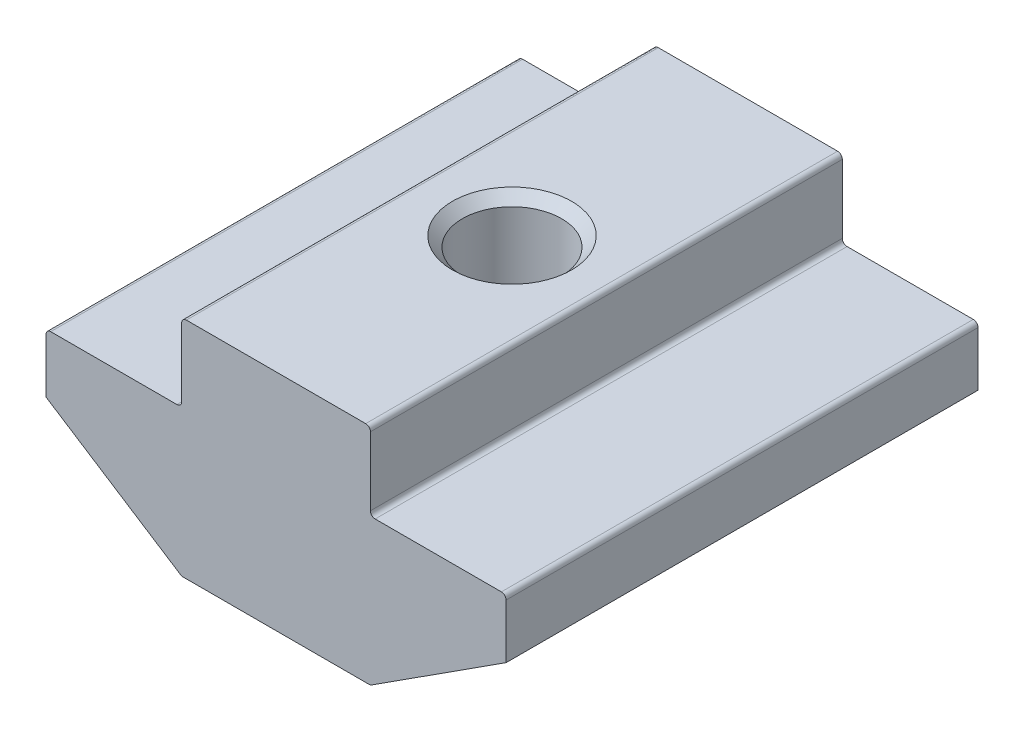
ISO-10303-21;
HEADER;
FILE_DESCRIPTION(('STEP AP214'),'2;1');
FILE_NAME('part.step','',(''),(''),'','','');
FILE_SCHEMA(('AUTOMOTIVE_DESIGN { 1 0 10303 214 1 1 1 1 }'));
ENDSEC;
DATA;
#1=APPLICATION_CONTEXT('core data for automotive mechanical design processes');
#2=APPLICATION_PROTOCOL_DEFINITION('international standard','automotive_design',2000,#1);
#3=PRODUCT_CONTEXT('',#1,'mechanical');
#4=PRODUCT('Part','Part','',(#3));
#5=PRODUCT_RELATED_PRODUCT_CATEGORY('part','',(#4));
#6=PRODUCT_DEFINITION_FORMATION('','',#4);
#7=PRODUCT_DEFINITION_CONTEXT('part definition',#1,'design');
#8=PRODUCT_DEFINITION('design','',#6,#7);
#9=PRODUCT_DEFINITION_SHAPE('','',#8);
#10=(LENGTH_UNIT() NAMED_UNIT(*) SI_UNIT(.MILLI.,.METRE.));
#11=(NAMED_UNIT(*) PLANE_ANGLE_UNIT() SI_UNIT($,.RADIAN.));
#12=(NAMED_UNIT(*) SI_UNIT($,.STERADIAN.) SOLID_ANGLE_UNIT());
#13=UNCERTAINTY_MEASURE_WITH_UNIT(LENGTH_MEASURE(1.E-05),#10,'distance_accuracy_value','');
#14=(GEOMETRIC_REPRESENTATION_CONTEXT(3) GLOBAL_UNCERTAINTY_ASSIGNED_CONTEXT((#13)) GLOBAL_UNIT_ASSIGNED_CONTEXT((#10,
#11,#12)) REPRESENTATION_CONTEXT('',''));
#15=CARTESIAN_POINT('',(0.,0.,0.));
#16=DIRECTION('',(0.,0.,1.));
#17=DIRECTION('',(1.,0.,0.));
#18=AXIS2_PLACEMENT_3D('',#15,#16,#17);
#19=CARTESIAN_POINT('',(-4.,0.,10.));
#20=DIRECTION('',(1.,0.,0.));
#21=DIRECTION('',(0.,0.,-1.));
#22=AXIS2_PLACEMENT_3D('',#19,#20,#21);
#23=PLANE('',#22);
#24=DIRECTION('',(0.,-1.,0.));
#25=VECTOR('',#24,1.);
#26=CARTESIAN_POINT('',(-4.,0.,10.));
#27=LINE('',#26,#25);
#28=CARTESIAN_POINT('',(-4.,-0.200000000000002,10.));
#29=VERTEX_POINT('',#28);
#30=CARTESIAN_POINT('',(-4.,-3.1,10.));
#31=VERTEX_POINT('',#30);
#32=EDGE_CURVE('E234',#29,#31,#27,.T.);
#33=ORIENTED_EDGE('',*,*,#32,.F.);
#34=DIRECTION('',(0.,0.,-1.));
#35=VECTOR('',#34,1.);
#36=CARTESIAN_POINT('',(-4.,-0.200000000000002,10.));
#37=LINE('',#36,#35);
#38=CARTESIAN_POINT('',(-4.,-0.200000000000002,-10.));
#39=VERTEX_POINT('',#38);
#40=EDGE_CURVE('E285',#29,#39,#37,.T.);
#41=ORIENTED_EDGE('',*,*,#40,.T.);
#42=DIRECTION('',(0.,-1.,0.));
#43=VECTOR('',#42,1.);
#44=CARTESIAN_POINT('',(-4.,0.,-10.));
#45=LINE('',#44,#43);
#46=CARTESIAN_POINT('',(-4.,-3.1,-10.));
#47=VERTEX_POINT('',#46);
#48=EDGE_CURVE('E208',#39,#47,#45,.T.);
#49=ORIENTED_EDGE('',*,*,#48,.T.);
#50=DIRECTION('',(0.,0.,-1.));
#51=VECTOR('',#50,1.);
#52=CARTESIAN_POINT('',(-4.,-3.1,10.));
#53=LINE('',#52,#51);
#54=EDGE_CURVE('E283',#47,#31,#53,.F.);
#55=ORIENTED_EDGE('',*,*,#54,.T.);
#56=EDGE_LOOP('',(#33,#41,#49,#55));
#57=FACE_BOUND('',#56,.T.);
#58=ADVANCED_FACE('F37',(#57),#23,.F.);
#59=CARTESIAN_POINT('',(-4.,-3.3,10.));
#60=DIRECTION('',(0.,-1.,0.));
#61=DIRECTION('',(1.,0.,0.));
#62=AXIS2_PLACEMENT_3D('',#59,#60,#61);
#63=PLANE('',#62);
#64=DIRECTION('',(-1.,0.,0.));
#65=VECTOR('',#64,1.);
#66=CARTESIAN_POINT('',(-4.,-3.3,-10.));
#67=LINE('',#66,#65);
#68=CARTESIAN_POINT('',(-4.2,-3.3,-10.));
#69=VERTEX_POINT('',#68);
#70=CARTESIAN_POINT('',(-9.55,-3.3,-10.));
#71=VERTEX_POINT('',#70);
#72=EDGE_CURVE('E211',#69,#71,#67,.T.);
#73=ORIENTED_EDGE('',*,*,#72,.T.);
#74=DIRECTION('',(0.,0.,-1.));
#75=VECTOR('',#74,1.);
#76=CARTESIAN_POINT('',(-9.55,-3.3,10.));
#77=LINE('',#76,#75);
#78=CARTESIAN_POINT('',(-9.55,-3.3,10.));
#79=VERTEX_POINT('',#78);
#80=EDGE_CURVE('E293',#71,#79,#77,.F.);
#81=ORIENTED_EDGE('',*,*,#80,.T.);
#82=DIRECTION('',(-1.,0.,0.));
#83=VECTOR('',#82,1.);
#84=CARTESIAN_POINT('',(-4.,-3.3,10.));
#85=LINE('',#84,#83);
#86=CARTESIAN_POINT('',(-4.2,-3.3,10.));
#87=VERTEX_POINT('',#86);
#88=EDGE_CURVE('E175',#87,#79,#85,.T.);
#89=ORIENTED_EDGE('',*,*,#88,.F.);
#90=DIRECTION('',(0.,0.,-1.));
#91=VECTOR('',#90,1.);
#92=CARTESIAN_POINT('',(-4.2,-3.3,-10.));
#93=LINE('',#92,#91);
#94=EDGE_CURVE('E290',#87,#69,#93,.T.);
#95=ORIENTED_EDGE('',*,*,#94,.T.);
#96=EDGE_LOOP('',(#73,#81,#89,#95));
#97=FACE_BOUND('',#96,.T.);
#98=ADVANCED_FACE('F313',(#97),#63,.F.);
#99=CARTESIAN_POINT('',(-9.75,-3.3,10.));
#100=DIRECTION('',(1.,0.,0.));
#101=DIRECTION('',(0.,0.,-1.));
#102=AXIS2_PLACEMENT_3D('',#99,#100,#101);
#103=PLANE('',#102);
#104=DIRECTION('',(0.,-1.,0.));
#105=VECTOR('',#104,1.);
#106=CARTESIAN_POINT('',(-9.75,-3.3,10.));
#107=LINE('',#106,#105);
#108=CARTESIAN_POINT('',(-9.75,-3.5,10.));
#109=VERTEX_POINT('',#108);
#110=CARTESIAN_POINT('',(-9.75,-5.8,10.));
#111=VERTEX_POINT('',#110);
#112=EDGE_CURVE('E162',#109,#111,#107,.T.);
#113=ORIENTED_EDGE('',*,*,#112,.F.);
#114=DIRECTION('',(0.,0.,-1.));
#115=VECTOR('',#114,1.);
#116=CARTESIAN_POINT('',(-9.75,-3.5,10.));
#117=LINE('',#116,#115);
#118=CARTESIAN_POINT('',(-9.75,-3.5,-10.));
#119=VERTEX_POINT('',#118);
#120=EDGE_CURVE('E288',#109,#119,#117,.T.);
#121=ORIENTED_EDGE('',*,*,#120,.T.);
#122=DIRECTION('',(0.,-1.,0.));
#123=VECTOR('',#122,1.);
#124=CARTESIAN_POINT('',(-9.75,-3.3,-10.));
#125=LINE('',#124,#123);
#126=CARTESIAN_POINT('',(-9.75,-5.8,-10.));
#127=VERTEX_POINT('',#126);
#128=EDGE_CURVE('E181',#119,#127,#125,.T.);
#129=ORIENTED_EDGE('',*,*,#128,.T.);
#130=DIRECTION('',(0.,0.,-1.));
#131=VECTOR('',#130,1.);
#132=CARTESIAN_POINT('',(-9.75,-5.8,10.));
#133=LINE('',#132,#131);
#134=EDGE_CURVE('E178',#111,#127,#133,.T.);
#135=ORIENTED_EDGE('',*,*,#134,.F.);
#136=EDGE_LOOP('',(#113,#121,#129,#135));
#137=FACE_BOUND('',#136,.T.);
#138=ADVANCED_FACE('F179',(#137),#103,.F.);
#139=CARTESIAN_POINT('',(-9.75,-5.8,10.));
#140=DIRECTION('',(0.541127125407786,0.840940802998586,0.));
#141=DIRECTION('',(-0.840940802998586,0.541127125407786,0.));
#142=AXIS2_PLACEMENT_3D('',#139,#140,#141);
#143=PLANE('',#142);
#144=DIRECTION('',(0.840940802998586,-0.541127125407786,0.));
#145=VECTOR('',#144,1.);
#146=CARTESIAN_POINT('',(-9.75,-5.8,-10.));
#147=LINE('',#146,#145);
#148=CARTESIAN_POINT('',(-4.04943731798692,-9.46818816059972,-10.));
#149=VERTEX_POINT('',#148);
#150=EDGE_CURVE('E216',#127,#149,#147,.T.);
#151=ORIENTED_EDGE('',*,*,#150,.T.);
#152=DIRECTION('',(0.,0.,-1.));
#153=VECTOR('',#152,1.);
#154=CARTESIAN_POINT('',(-4.04943731798692,-9.46818816059972,10.));
#155=LINE('',#154,#153);
#156=CARTESIAN_POINT('',(-4.04943731798692,-9.46818816059972,10.));
#157=VERTEX_POINT('',#156);
#158=EDGE_CURVE('E190',#149,#157,#155,.F.);
#159=ORIENTED_EDGE('',*,*,#158,.T.);
#160=DIRECTION('',(0.840940802998586,-0.541127125407786,0.));
#161=VECTOR('',#160,1.);
#162=CARTESIAN_POINT('',(-9.75,-5.8,10.));
#163=LINE('',#162,#161);
#164=EDGE_CURVE('E167',#111,#157,#163,.T.);
#165=ORIENTED_EDGE('',*,*,#164,.F.);
#166=ORIENTED_EDGE('',*,*,#134,.T.);
#167=EDGE_LOOP('',(#151,#159,#165,#166));
#168=FACE_BOUND('',#167,.T.);
#169=ADVANCED_FACE('F188',(#168),#143,.F.);
#170=CARTESIAN_POINT('',(-4.,-9.5,10.));
#171=DIRECTION('',(0.,1.,0.));
#172=DIRECTION('',(0.,0.,1.));
#173=AXIS2_PLACEMENT_3D('',#170,#171,#172);
#174=PLANE('',#173);
#175=CARTESIAN_POINT('',(0.,-9.5,0.));
#176=DIRECTION('',(0.,1.,0.));
#177=DIRECTION('',(0.,0.,1.));
#178=AXIS2_PLACEMENT_3D('',#175,#176,#177);
#179=CIRCLE('',#178,2.525);
#180=CARTESIAN_POINT('',(0.,-9.5,2.525));
#181=VERTEX_POINT('',#180);
#182=EDGE_CURVE('E325',#181,#181,#179,.T.);
#183=ORIENTED_EDGE('',*,*,#182,.T.);
#184=EDGE_LOOP('',(#183));
#185=FACE_BOUND('',#184,.T.);
#186=DIRECTION('',(1.,0.,0.));
#187=VECTOR('',#186,1.);
#188=CARTESIAN_POINT('',(-4.,-9.5,-10.));
#189=LINE('',#188,#187);
#190=CARTESIAN_POINT('',(-3.94121189290537,-9.5,-10.));
#191=VERTEX_POINT('',#190);
#192=CARTESIAN_POINT('',(3.94121189290537,-9.5,-10.));
#193=VERTEX_POINT('',#192);
#194=EDGE_CURVE('E218',#191,#193,#189,.T.);
#195=ORIENTED_EDGE('',*,*,#194,.T.);
#196=DIRECTION('',(0.,0.,-1.));
#197=VECTOR('',#196,1.);
#198=CARTESIAN_POINT('',(3.94121189290537,-9.5,10.));
#199=LINE('',#198,#197);
#200=CARTESIAN_POINT('',(3.94121189290537,-9.5,10.));
#201=VERTEX_POINT('',#200);
#202=EDGE_CURVE('E254',#193,#201,#199,.F.);
#203=ORIENTED_EDGE('',*,*,#202,.T.);
#204=DIRECTION('',(1.,0.,0.));
#205=VECTOR('',#204,1.);
#206=CARTESIAN_POINT('',(-4.,-9.5,10.));
#207=LINE('',#206,#205);
#208=CARTESIAN_POINT('',(-3.94121189290537,-9.5,10.));
#209=VERTEX_POINT('',#208);
#210=EDGE_CURVE('E191',#209,#201,#207,.T.);
#211=ORIENTED_EDGE('',*,*,#210,.F.);
#212=DIRECTION('',(0.,0.,-1.));
#213=VECTOR('',#212,1.);
#214=CARTESIAN_POINT('',(-3.94121189290537,-9.5,10.));
#215=LINE('',#214,#213);
#216=EDGE_CURVE('E251',#209,#191,#215,.T.);
#217=ORIENTED_EDGE('',*,*,#216,.T.);
#218=EDGE_LOOP('',(#195,#203,#211,#217));
#219=FACE_BOUND('',#218,.T.);
#220=ADVANCED_FACE('F329',(#185,#219),#174,.F.);
#221=CARTESIAN_POINT('',(9.75,-5.8,10.));
#222=DIRECTION('',(-0.541127125407786,0.840940802998586,0.));
#223=DIRECTION('',(-0.840940802998586,-0.541127125407786,0.));
#224=AXIS2_PLACEMENT_3D('',#221,#222,#223);
#225=PLANE('',#224);
#226=DIRECTION('',(0.840940802998586,0.541127125407786,0.));
#227=VECTOR('',#226,1.);
#228=CARTESIAN_POINT('',(9.75,-5.8,10.));
#229=LINE('',#228,#227);
#230=CARTESIAN_POINT('',(4.04943731798692,-9.46818816059972,10.));
#231=VERTEX_POINT('',#230);
#232=CARTESIAN_POINT('',(9.75,-5.8,10.));
#233=VERTEX_POINT('',#232);
#234=EDGE_CURVE('E193',#231,#233,#229,.T.);
#235=ORIENTED_EDGE('',*,*,#234,.F.);
#236=DIRECTION('',(0.,0.,-1.));
#237=VECTOR('',#236,1.);
#238=CARTESIAN_POINT('',(4.04943731798692,-9.46818816059972,10.));
#239=LINE('',#238,#237);
#240=CARTESIAN_POINT('',(4.04943731798692,-9.46818816059972,-10.));
#241=VERTEX_POINT('',#240);
#242=EDGE_CURVE('E185',#231,#241,#239,.T.);
#243=ORIENTED_EDGE('',*,*,#242,.T.);
#244=DIRECTION('',(0.840940802998586,0.541127125407786,0.));
#245=VECTOR('',#244,1.);
#246=CARTESIAN_POINT('',(9.75,-5.8,-10.));
#247=LINE('',#246,#245);
#248=CARTESIAN_POINT('',(9.75,-5.8,-10.));
#249=VERTEX_POINT('',#248);
#250=EDGE_CURVE('E221',#241,#249,#247,.T.);
#251=ORIENTED_EDGE('',*,*,#250,.T.);
#252=DIRECTION('',(0.,0.,-1.));
#253=VECTOR('',#252,1.);
#254=CARTESIAN_POINT('',(9.75,-5.8,10.));
#255=LINE('',#254,#253);
#256=EDGE_CURVE('E186',#233,#249,#255,.T.);
#257=ORIENTED_EDGE('',*,*,#256,.F.);
#258=EDGE_LOOP('',(#235,#243,#251,#257));
#259=FACE_BOUND('',#258,.T.);
#260=ADVANCED_FACE('F385',(#259),#225,.F.);
#261=CARTESIAN_POINT('',(9.75,-3.3,10.));
#262=DIRECTION('',(-1.,0.,0.));
#263=DIRECTION('',(0.,0.,1.));
#264=AXIS2_PLACEMENT_3D('',#261,#262,#263);
#265=PLANE('',#264);
#266=DIRECTION('',(0.,1.,0.));
#267=VECTOR('',#266,1.);
#268=CARTESIAN_POINT('',(9.75,-3.3,-10.));
#269=LINE('',#268,#267);
#270=CARTESIAN_POINT('',(9.75,-3.5,-10.));
#271=VERTEX_POINT('',#270);
#272=EDGE_CURVE('E223',#249,#271,#269,.T.);
#273=ORIENTED_EDGE('',*,*,#272,.T.);
#274=DIRECTION('',(0.,0.,-1.));
#275=VECTOR('',#274,1.);
#276=CARTESIAN_POINT('',(9.75,-3.5,10.));
#277=LINE('',#276,#275);
#278=CARTESIAN_POINT('',(9.75,-3.5,10.));
#279=VERTEX_POINT('',#278);
#280=EDGE_CURVE('E272',#271,#279,#277,.F.);
#281=ORIENTED_EDGE('',*,*,#280,.T.);
#282=DIRECTION('',(0.,1.,0.));
#283=VECTOR('',#282,1.);
#284=CARTESIAN_POINT('',(9.75,-3.3,10.));
#285=LINE('',#284,#283);
#286=EDGE_CURVE('E198',#233,#279,#285,.T.);
#287=ORIENTED_EDGE('',*,*,#286,.F.);
#288=ORIENTED_EDGE('',*,*,#256,.T.);
#289=EDGE_LOOP('',(#273,#281,#287,#288));
#290=FACE_BOUND('',#289,.T.);
#291=ADVANCED_FACE('F380',(#290),#265,.F.);
#292=CARTESIAN_POINT('',(4.,-3.3,10.));
#293=DIRECTION('',(0.,-1.,0.));
#294=DIRECTION('',(1.,0.,0.));
#295=AXIS2_PLACEMENT_3D('',#292,#293,#294);
#296=PLANE('',#295);
#297=DIRECTION('',(-1.,0.,0.));
#298=VECTOR('',#297,1.);
#299=CARTESIAN_POINT('',(4.,-3.3,10.));
#300=LINE('',#299,#298);
#301=CARTESIAN_POINT('',(9.55,-3.3,10.));
#302=VERTEX_POINT('',#301);
#303=CARTESIAN_POINT('',(4.2,-3.3,10.));
#304=VERTEX_POINT('',#303);
#305=EDGE_CURVE('E201',#302,#304,#300,.T.);
#306=ORIENTED_EDGE('',*,*,#305,.F.);
#307=DIRECTION('',(0.,0.,-1.));
#308=VECTOR('',#307,1.);
#309=CARTESIAN_POINT('',(9.55,-3.3,10.));
#310=LINE('',#309,#308);
#311=CARTESIAN_POINT('',(9.55,-3.3,-10.));
#312=VERTEX_POINT('',#311);
#313=EDGE_CURVE('E269',#302,#312,#310,.T.);
#314=ORIENTED_EDGE('',*,*,#313,.T.);
#315=DIRECTION('',(-1.,0.,0.));
#316=VECTOR('',#315,1.);
#317=CARTESIAN_POINT('',(4.,-3.3,-10.));
#318=LINE('',#317,#316);
#319=CARTESIAN_POINT('',(4.2,-3.3,-10.));
#320=VERTEX_POINT('',#319);
#321=EDGE_CURVE('E226',#312,#320,#318,.T.);
#322=ORIENTED_EDGE('',*,*,#321,.T.);
#323=DIRECTION('',(0.,0.,-1.));
#324=VECTOR('',#323,1.);
#325=CARTESIAN_POINT('',(4.2,-3.3,10.));
#326=LINE('',#325,#324);
#327=EDGE_CURVE('E267',#320,#304,#326,.F.);
#328=ORIENTED_EDGE('',*,*,#327,.T.);
#329=EDGE_LOOP('',(#306,#314,#322,#328));
#330=FACE_BOUND('',#329,.T.);
#331=ADVANCED_FACE('F372',(#330),#296,.F.);
#332=CARTESIAN_POINT('',(4.,0.,10.));
#333=DIRECTION('',(-1.,0.,0.));
#334=DIRECTION('',(0.,0.,1.));
#335=AXIS2_PLACEMENT_3D('',#332,#333,#334);
#336=PLANE('',#335);
#337=DIRECTION('',(0.,1.,0.));
#338=VECTOR('',#337,1.);
#339=CARTESIAN_POINT('',(4.,0.,10.));
#340=LINE('',#339,#338);
#341=CARTESIAN_POINT('',(4.,-3.1,10.));
#342=VERTEX_POINT('',#341);
#343=CARTESIAN_POINT('',(4.,-0.199999999999998,10.));
#344=VERTEX_POINT('',#343);
#345=EDGE_CURVE('E204',#342,#344,#340,.T.);
#346=ORIENTED_EDGE('',*,*,#345,.F.);
#347=DIRECTION('',(0.,0.,-1.));
#348=VECTOR('',#347,1.);
#349=CARTESIAN_POINT('',(4.,-3.1,-10.));
#350=LINE('',#349,#348);
#351=CARTESIAN_POINT('',(4.,-3.1,-10.));
#352=VERTEX_POINT('',#351);
#353=EDGE_CURVE('E276',#342,#352,#350,.T.);
#354=ORIENTED_EDGE('',*,*,#353,.T.);
#355=DIRECTION('',(0.,1.,0.));
#356=VECTOR('',#355,1.);
#357=CARTESIAN_POINT('',(4.,0.,-10.));
#358=LINE('',#357,#356);
#359=CARTESIAN_POINT('',(4.,-0.199999999999998,-10.));
#360=VERTEX_POINT('',#359);
#361=EDGE_CURVE('E229',#352,#360,#358,.T.);
#362=ORIENTED_EDGE('',*,*,#361,.T.);
#363=DIRECTION('',(0.,0.,-1.));
#364=VECTOR('',#363,1.);
#365=CARTESIAN_POINT('',(4.,-0.199999999999998,10.));
#366=LINE('',#365,#364);
#367=EDGE_CURVE('E274',#360,#344,#366,.F.);
#368=ORIENTED_EDGE('',*,*,#367,.T.);
#369=EDGE_LOOP('',(#346,#354,#362,#368));
#370=FACE_BOUND('',#369,.T.);
#371=ADVANCED_FACE('F353',(#370),#336,.F.);
#372=CARTESIAN_POINT('',(4.,0.,10.));
#373=DIRECTION('',(0.,-1.,0.));
#374=DIRECTION('',(1.,0.,0.));
#375=AXIS2_PLACEMENT_3D('',#372,#373,#374);
#376=PLANE('',#375);
#377=CARTESIAN_POINT('',(0.,0.,0.));
#378=DIRECTION('',(0.,1.,0.));
#379=DIRECTION('',(0.,0.,1.));
#380=AXIS2_PLACEMENT_3D('',#377,#378,#379);
#381=CIRCLE('',#380,2.525);
#382=CARTESIAN_POINT('',(0.,0.,2.525));
#383=VERTEX_POINT('',#382);
#384=EDGE_CURVE('E322',#383,#383,#381,.T.);
#385=ORIENTED_EDGE('',*,*,#384,.F.);
#386=EDGE_LOOP('',(#385));
#387=FACE_BOUND('',#386,.T.);
#388=DIRECTION('',(-1.,0.,0.));
#389=VECTOR('',#388,1.);
#390=CARTESIAN_POINT('',(4.,0.,10.));
#391=LINE('',#390,#389);
#392=CARTESIAN_POINT('',(3.8,0.,10.));
#393=VERTEX_POINT('',#392);
#394=CARTESIAN_POINT('',(-3.8,0.,10.));
#395=VERTEX_POINT('',#394);
#396=EDGE_CURVE('E206',#393,#395,#391,.T.);
#397=ORIENTED_EDGE('',*,*,#396,.F.);
#398=DIRECTION('',(0.,0.,-1.));
#399=VECTOR('',#398,1.);
#400=CARTESIAN_POINT('',(3.8,0.,10.));
#401=LINE('',#400,#399);
#402=CARTESIAN_POINT('',(3.8,0.,-10.));
#403=VERTEX_POINT('',#402);
#404=EDGE_CURVE('E280',#393,#403,#401,.T.);
#405=ORIENTED_EDGE('',*,*,#404,.T.);
#406=DIRECTION('',(-1.,0.,0.));
#407=VECTOR('',#406,1.);
#408=CARTESIAN_POINT('',(4.,0.,-10.));
#409=LINE('',#408,#407);
#410=CARTESIAN_POINT('',(-3.8,0.,-10.));
#411=VERTEX_POINT('',#410);
#412=EDGE_CURVE('E232',#403,#411,#409,.T.);
#413=ORIENTED_EDGE('',*,*,#412,.T.);
#414=DIRECTION('',(0.,0.,-1.));
#415=VECTOR('',#414,1.);
#416=CARTESIAN_POINT('',(-3.8,0.,10.));
#417=LINE('',#416,#415);
#418=EDGE_CURVE('E52',#411,#395,#417,.F.);
#419=ORIENTED_EDGE('',*,*,#418,.T.);
#420=EDGE_LOOP('',(#397,#405,#413,#419));
#421=FACE_BOUND('',#420,.T.);
#422=ADVANCED_FACE('F351',(#387,#421),#376,.F.);
#423=CARTESIAN_POINT('',(0.,0.,10.));
#424=DIRECTION('',(0.,0.,-1.));
#425=DIRECTION('',(-1.,0.,0.));
#426=AXIS2_PLACEMENT_3D('',#423,#424,#425);
#427=PLANE('',#426);
#428=ORIENTED_EDGE('',*,*,#210,.T.);
#429=CARTESIAN_POINT('',(3.94121189290537,-9.3,10.));
#430=DIRECTION('',(0.,0.,-1.));
#431=DIRECTION('',(-1.,0.,0.));
#432=AXIS2_PLACEMENT_3D('',#429,#430,#431);
#433=CIRCLE('',#432,0.2);
#434=EDGE_CURVE('E264',#201,#231,#433,.F.);
#435=ORIENTED_EDGE('',*,*,#434,.T.);
#436=ORIENTED_EDGE('',*,*,#234,.T.);
#437=ORIENTED_EDGE('',*,*,#286,.T.);
#438=CARTESIAN_POINT('',(9.55,-3.5,10.));
#439=DIRECTION('',(0.,0.,-1.));
#440=DIRECTION('',(-1.,0.,0.));
#441=AXIS2_PLACEMENT_3D('',#438,#439,#440);
#442=CIRCLE('',#441,0.2);
#443=EDGE_CURVE('E260',#279,#302,#442,.F.);
#444=ORIENTED_EDGE('',*,*,#443,.T.);
#445=ORIENTED_EDGE('',*,*,#305,.T.);
#446=CARTESIAN_POINT('',(4.2,-3.1,10.));
#447=DIRECTION('',(0.,0.,-1.));
#448=DIRECTION('',(-1.,0.,0.));
#449=AXIS2_PLACEMENT_3D('',#446,#447,#448);
#450=CIRCLE('',#449,0.2);
#451=EDGE_CURVE('E297',#304,#342,#450,.T.);
#452=ORIENTED_EDGE('',*,*,#451,.T.);
#453=ORIENTED_EDGE('',*,*,#345,.T.);
#454=CARTESIAN_POINT('',(3.8,-0.199999999999998,10.));
#455=DIRECTION('',(0.,0.,-1.));
#456=DIRECTION('',(-1.,0.,0.));
#457=AXIS2_PLACEMENT_3D('',#454,#455,#456);
#458=CIRCLE('',#457,0.2);
#459=EDGE_CURVE('E59',#344,#393,#458,.F.);
#460=ORIENTED_EDGE('',*,*,#459,.T.);
#461=ORIENTED_EDGE('',*,*,#396,.T.);
#462=CARTESIAN_POINT('',(-3.8,-0.200000000000002,10.));
#463=DIRECTION('',(0.,0.,-1.));
#464=DIRECTION('',(-1.,0.,0.));
#465=AXIS2_PLACEMENT_3D('',#462,#463,#464);
#466=CIRCLE('',#465,0.2);
#467=EDGE_CURVE('E257',#395,#29,#466,.F.);
#468=ORIENTED_EDGE('',*,*,#467,.T.);
#469=ORIENTED_EDGE('',*,*,#32,.T.);
#470=CARTESIAN_POINT('',(-4.2,-3.1,10.));
#471=DIRECTION('',(0.,0.,-1.));
#472=DIRECTION('',(-1.,0.,0.));
#473=AXIS2_PLACEMENT_3D('',#470,#471,#472);
#474=CIRCLE('',#473,0.2);
#475=EDGE_CURVE('E11',#31,#87,#474,.T.);
#476=ORIENTED_EDGE('',*,*,#475,.T.);
#477=ORIENTED_EDGE('',*,*,#88,.T.);
#478=CARTESIAN_POINT('',(-9.55,-3.5,10.));
#479=DIRECTION('',(0.,0.,-1.));
#480=DIRECTION('',(-1.,0.,0.));
#481=AXIS2_PLACEMENT_3D('',#478,#479,#480);
#482=CIRCLE('',#481,0.2);
#483=EDGE_CURVE('E171',#79,#109,#482,.F.);
#484=ORIENTED_EDGE('',*,*,#483,.T.);
#485=ORIENTED_EDGE('',*,*,#112,.T.);
#486=ORIENTED_EDGE('',*,*,#164,.T.);
#487=CARTESIAN_POINT('',(-3.94121189290537,-9.3,10.));
#488=DIRECTION('',(0.,0.,-1.));
#489=DIRECTION('',(-1.,0.,0.));
#490=AXIS2_PLACEMENT_3D('',#487,#488,#489);
#491=CIRCLE('',#490,0.2);
#492=EDGE_CURVE('E262',#157,#209,#491,.F.);
#493=ORIENTED_EDGE('',*,*,#492,.T.);
#494=EDGE_LOOP('',(#428,#435,#436,#437,#444,#445,#452,#453,#460,#461,#468,#469,#476,#477,#484,
#485,#486,#493));
#495=FACE_BOUND('',#494,.T.);
#496=ADVANCED_FACE('F165',(#495),#427,.F.);
#497=CARTESIAN_POINT('',(0.,0.,-10.));
#498=DIRECTION('',(0.,0.,-1.));
#499=DIRECTION('',(-1.,0.,0.));
#500=AXIS2_PLACEMENT_3D('',#497,#498,#499);
#501=PLANE('',#500);
#502=ORIENTED_EDGE('',*,*,#250,.F.);
#503=CARTESIAN_POINT('',(3.94121189290537,-9.3,-10.));
#504=DIRECTION('',(0.,0.,-1.));
#505=DIRECTION('',(-1.,0.,0.));
#506=AXIS2_PLACEMENT_3D('',#503,#504,#505);
#507=CIRCLE('',#506,0.2);
#508=EDGE_CURVE('E249',#241,#193,#507,.T.);
#509=ORIENTED_EDGE('',*,*,#508,.T.);
#510=ORIENTED_EDGE('',*,*,#194,.F.);
#511=CARTESIAN_POINT('',(-3.94121189290537,-9.3,-10.));
#512=DIRECTION('',(0.,0.,-1.));
#513=DIRECTION('',(-1.,0.,0.));
#514=AXIS2_PLACEMENT_3D('',#511,#512,#513);
#515=CIRCLE('',#514,0.2);
#516=EDGE_CURVE('E247',#191,#149,#515,.T.);
#517=ORIENTED_EDGE('',*,*,#516,.T.);
#518=ORIENTED_EDGE('',*,*,#150,.F.);
#519=ORIENTED_EDGE('',*,*,#128,.F.);
#520=CARTESIAN_POINT('',(-9.55,-3.5,-10.));
#521=DIRECTION('',(0.,0.,-1.));
#522=DIRECTION('',(-1.,0.,0.));
#523=AXIS2_PLACEMENT_3D('',#520,#521,#522);
#524=CIRCLE('',#523,0.2);
#525=EDGE_CURVE('E239',#119,#71,#524,.T.);
#526=ORIENTED_EDGE('',*,*,#525,.T.);
#527=ORIENTED_EDGE('',*,*,#72,.F.);
#528=CARTESIAN_POINT('',(-4.2,-3.1,-10.));
#529=DIRECTION('',(0.,0.,-1.));
#530=DIRECTION('',(-1.,0.,0.));
#531=AXIS2_PLACEMENT_3D('',#528,#529,#530);
#532=CIRCLE('',#531,0.2);
#533=EDGE_CURVE('E45',#69,#47,#532,.F.);
#534=ORIENTED_EDGE('',*,*,#533,.T.);
#535=ORIENTED_EDGE('',*,*,#48,.F.);
#536=CARTESIAN_POINT('',(-3.8,-0.200000000000002,-10.));
#537=DIRECTION('',(0.,0.,-1.));
#538=DIRECTION('',(-1.,0.,0.));
#539=AXIS2_PLACEMENT_3D('',#536,#537,#538);
#540=CIRCLE('',#539,0.2);
#541=EDGE_CURVE('E241',#39,#411,#540,.T.);
#542=ORIENTED_EDGE('',*,*,#541,.T.);
#543=ORIENTED_EDGE('',*,*,#412,.F.);
#544=CARTESIAN_POINT('',(3.8,-0.199999999999998,-10.));
#545=DIRECTION('',(0.,0.,-1.));
#546=DIRECTION('',(-1.,0.,0.));
#547=AXIS2_PLACEMENT_3D('',#544,#545,#546);
#548=CIRCLE('',#547,0.2);
#549=EDGE_CURVE('E243',#403,#360,#548,.T.);
#550=ORIENTED_EDGE('',*,*,#549,.T.);
#551=ORIENTED_EDGE('',*,*,#361,.F.);
#552=CARTESIAN_POINT('',(4.2,-3.1,-10.));
#553=DIRECTION('',(0.,0.,-1.));
#554=DIRECTION('',(-1.,0.,0.));
#555=AXIS2_PLACEMENT_3D('',#552,#553,#554);
#556=CIRCLE('',#555,0.2);
#557=EDGE_CURVE('E295',#352,#320,#556,.F.);
#558=ORIENTED_EDGE('',*,*,#557,.T.);
#559=ORIENTED_EDGE('',*,*,#321,.F.);
#560=CARTESIAN_POINT('',(9.55,-3.5,-10.));
#561=DIRECTION('',(0.,0.,-1.));
#562=DIRECTION('',(-1.,0.,0.));
#563=AXIS2_PLACEMENT_3D('',#560,#561,#562);
#564=CIRCLE('',#563,0.2);
#565=EDGE_CURVE('E245',#312,#271,#564,.T.);
#566=ORIENTED_EDGE('',*,*,#565,.T.);
#567=ORIENTED_EDGE('',*,*,#272,.F.);
#568=EDGE_LOOP('',(#502,#509,#510,#517,#518,#519,#526,#527,#534,#535,#542,#543,#550,#551,#558,
#559,#566,#567));
#569=FACE_BOUND('',#568,.T.);
#570=ADVANCED_FACE('F302',(#569),#501,.T.);
#571=CARTESIAN_POINT('',(0.,-9.075,0.));
#572=DIRECTION('',(0.,-1.,0.));
#573=DIRECTION('',(0.,0.,-1.));
#574=AXIS2_PLACEMENT_3D('',#571,#572,#573);
#575=CONICAL_SURFACE('',#574,2.1,0.785398163397445);
#576=ORIENTED_EDGE('',*,*,#182,.F.);
#577=EDGE_LOOP('',(#576));
#578=FACE_BOUND('',#577,.T.);
#579=CARTESIAN_POINT('',(0.,-9.075,0.));
#580=DIRECTION('',(0.,1.,0.));
#581=DIRECTION('',(0.,0.,1.));
#582=AXIS2_PLACEMENT_3D('',#579,#580,#581);
#583=CIRCLE('',#582,2.1);
#584=CARTESIAN_POINT('',(0.,-9.075,2.1));
#585=VERTEX_POINT('',#584);
#586=EDGE_CURVE('E212',#585,#585,#583,.T.);
#587=ORIENTED_EDGE('',*,*,#586,.T.);
#588=EDGE_LOOP('',(#587));
#589=FACE_BOUND('',#588,.T.);
#590=ADVANCED_FACE('F332',(#578,#589),#575,.F.);
#591=CARTESIAN_POINT('',(0.,0.,0.));
#592=DIRECTION('',(0.,1.,0.));
#593=DIRECTION('',(0.,0.,1.));
#594=AXIS2_PLACEMENT_3D('',#591,#592,#593);
#595=CYLINDRICAL_SURFACE('',#594,2.1);
#596=ORIENTED_EDGE('',*,*,#586,.F.);
#597=EDGE_LOOP('',(#596));
#598=FACE_BOUND('',#597,.T.);
#599=CARTESIAN_POINT('',(0.,-0.424999999999999,0.));
#600=DIRECTION('',(0.,1.,0.));
#601=DIRECTION('',(0.,0.,1.));
#602=AXIS2_PLACEMENT_3D('',#599,#600,#601);
#603=CIRCLE('',#602,2.1);
#604=CARTESIAN_POINT('',(0.,-0.424999999999999,2.1));
#605=VERTEX_POINT('',#604);
#606=EDGE_CURVE('E319',#605,#605,#603,.T.);
#607=ORIENTED_EDGE('',*,*,#606,.T.);
#608=EDGE_LOOP('',(#607));
#609=FACE_BOUND('',#608,.T.);
#610=ADVANCED_FACE('F335',(#598,#609),#595,.F.);
#611=CARTESIAN_POINT('',(0.,0.,0.));
#612=DIRECTION('',(0.,1.,0.));
#613=DIRECTION('',(0.,0.,1.));
#614=AXIS2_PLACEMENT_3D('',#611,#612,#613);
#615=CONICAL_SURFACE('',#614,2.525,0.78539816339745);
#616=ORIENTED_EDGE('',*,*,#606,.F.);
#617=EDGE_LOOP('',(#616));
#618=FACE_BOUND('',#617,.T.);
#619=ORIENTED_EDGE('',*,*,#384,.T.);
#620=EDGE_LOOP('',(#619));
#621=FACE_BOUND('',#620,.T.);
#622=ADVANCED_FACE('F341',(#618,#621),#615,.F.);
#623=CARTESIAN_POINT('',(3.94121189290537,-9.3,10.));
#624=DIRECTION('',(0.,0.,-1.));
#625=DIRECTION('',(-1.,0.,0.));
#626=AXIS2_PLACEMENT_3D('',#623,#624,#625);
#627=CYLINDRICAL_SURFACE('',#626,0.2);
#628=ORIENTED_EDGE('',*,*,#434,.F.);
#629=ORIENTED_EDGE('',*,*,#202,.F.);
#630=ORIENTED_EDGE('',*,*,#508,.F.);
#631=ORIENTED_EDGE('',*,*,#242,.F.);
#632=EDGE_LOOP('',(#628,#629,#630,#631));
#633=FACE_BOUND('',#632,.T.);
#634=ADVANCED_FACE('F347',(#633),#627,.T.);
#635=CARTESIAN_POINT('',(-3.94121189290537,-9.3,10.));
#636=DIRECTION('',(0.,0.,-1.));
#637=DIRECTION('',(-1.,0.,0.));
#638=AXIS2_PLACEMENT_3D('',#635,#636,#637);
#639=CYLINDRICAL_SURFACE('',#638,0.2);
#640=ORIENTED_EDGE('',*,*,#492,.F.);
#641=ORIENTED_EDGE('',*,*,#158,.F.);
#642=ORIENTED_EDGE('',*,*,#516,.F.);
#643=ORIENTED_EDGE('',*,*,#216,.F.);
#644=EDGE_LOOP('',(#640,#641,#642,#643));
#645=FACE_BOUND('',#644,.T.);
#646=ADVANCED_FACE('F394',(#645),#639,.T.);
#647=CARTESIAN_POINT('',(9.55,-3.5,10.));
#648=DIRECTION('',(0.,0.,-1.));
#649=DIRECTION('',(-1.,0.,0.));
#650=AXIS2_PLACEMENT_3D('',#647,#648,#649);
#651=CYLINDRICAL_SURFACE('',#650,0.2);
#652=ORIENTED_EDGE('',*,*,#443,.F.);
#653=ORIENTED_EDGE('',*,*,#280,.F.);
#654=ORIENTED_EDGE('',*,*,#565,.F.);
#655=ORIENTED_EDGE('',*,*,#313,.F.);
#656=EDGE_LOOP('',(#652,#653,#654,#655));
#657=FACE_BOUND('',#656,.T.);
#658=ADVANCED_FACE('F376',(#657),#651,.T.);
#659=CARTESIAN_POINT('',(4.2,-3.1,10.));
#660=DIRECTION('',(0.,0.,1.));
#661=DIRECTION('',(1.,0.,0.));
#662=AXIS2_PLACEMENT_3D('',#659,#660,#661);
#663=CYLINDRICAL_SURFACE('',#662,0.2);
#664=ORIENTED_EDGE('',*,*,#451,.F.);
#665=ORIENTED_EDGE('',*,*,#327,.F.);
#666=ORIENTED_EDGE('',*,*,#557,.F.);
#667=ORIENTED_EDGE('',*,*,#353,.F.);
#668=EDGE_LOOP('',(#664,#665,#666,#667));
#669=FACE_BOUND('',#668,.T.);
#670=ADVANCED_FACE('F367',(#669),#663,.F.);
#671=CARTESIAN_POINT('',(3.8,-0.199999999999998,10.));
#672=DIRECTION('',(0.,0.,-1.));
#673=DIRECTION('',(-1.,0.,0.));
#674=AXIS2_PLACEMENT_3D('',#671,#672,#673);
#675=CYLINDRICAL_SURFACE('',#674,0.2);
#676=ORIENTED_EDGE('',*,*,#459,.F.);
#677=ORIENTED_EDGE('',*,*,#367,.F.);
#678=ORIENTED_EDGE('',*,*,#549,.F.);
#679=ORIENTED_EDGE('',*,*,#404,.F.);
#680=EDGE_LOOP('',(#676,#677,#678,#679));
#681=FACE_BOUND('',#680,.T.);
#682=ADVANCED_FACE('F359',(#681),#675,.T.);
#683=CARTESIAN_POINT('',(-3.8,-0.200000000000002,10.));
#684=DIRECTION('',(0.,0.,-1.));
#685=DIRECTION('',(-1.,0.,0.));
#686=AXIS2_PLACEMENT_3D('',#683,#684,#685);
#687=CYLINDRICAL_SURFACE('',#686,0.2);
#688=ORIENTED_EDGE('',*,*,#467,.F.);
#689=ORIENTED_EDGE('',*,*,#418,.F.);
#690=ORIENTED_EDGE('',*,*,#541,.F.);
#691=ORIENTED_EDGE('',*,*,#40,.F.);
#692=EDGE_LOOP('',(#688,#689,#690,#691));
#693=FACE_BOUND('',#692,.T.);
#694=ADVANCED_FACE('F398',(#693),#687,.T.);
#695=CARTESIAN_POINT('',(-9.55,-3.5,10.));
#696=DIRECTION('',(0.,0.,-1.));
#697=DIRECTION('',(-1.,0.,0.));
#698=AXIS2_PLACEMENT_3D('',#695,#696,#697);
#699=CYLINDRICAL_SURFACE('',#698,0.2);
#700=ORIENTED_EDGE('',*,*,#483,.F.);
#701=ORIENTED_EDGE('',*,*,#80,.F.);
#702=ORIENTED_EDGE('',*,*,#525,.F.);
#703=ORIENTED_EDGE('',*,*,#120,.F.);
#704=EDGE_LOOP('',(#700,#701,#702,#703));
#705=FACE_BOUND('',#704,.T.);
#706=ADVANCED_FACE('F396',(#705),#699,.T.);
#707=CARTESIAN_POINT('',(-4.2,-3.1,10.));
#708=DIRECTION('',(0.,0.,1.));
#709=DIRECTION('',(1.,0.,0.));
#710=AXIS2_PLACEMENT_3D('',#707,#708,#709);
#711=CYLINDRICAL_SURFACE('',#710,0.2);
#712=ORIENTED_EDGE('',*,*,#475,.F.);
#713=ORIENTED_EDGE('',*,*,#54,.F.);
#714=ORIENTED_EDGE('',*,*,#533,.F.);
#715=ORIENTED_EDGE('',*,*,#94,.F.);
#716=EDGE_LOOP('',(#712,#713,#714,#715));
#717=FACE_BOUND('',#716,.T.);
#718=ADVANCED_FACE('F39',(#717),#711,.F.);
#719=CLOSED_SHELL('',(#58,#98,#138,#169,#220,#260,#291,#331,#371,#422,#496,#570,#590,#610,#622,
#634,#646,#658,#670,#682,#694,#706,#718));
#720=MANIFOLD_SOLID_BREP('B2',#719);
#721=ADVANCED_BREP_SHAPE_REPRESENTATION('',(#18,#720),#14);
#722=SHAPE_DEFINITION_REPRESENTATION(#9,#721);
ENDSEC;
END-ISO-10303-21;
